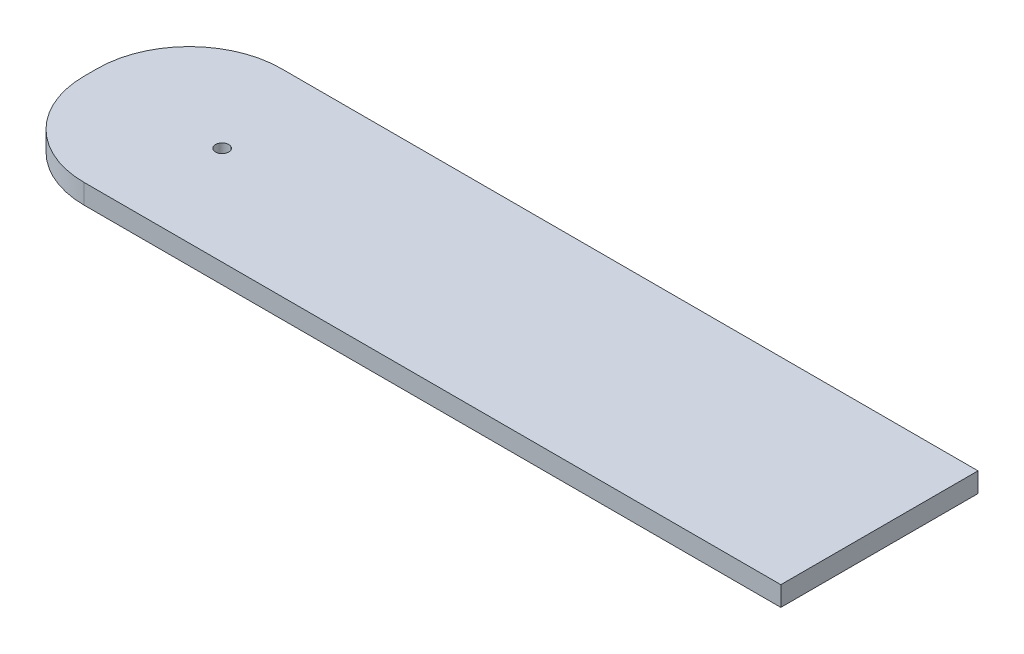
ISO-10303-21;
HEADER;
FILE_DESCRIPTION(('STEP AP214'),'2;1');
FILE_NAME('part.step','',(''),(''),'','','');
FILE_SCHEMA(('AUTOMOTIVE_DESIGN { 1 0 10303 214 1 1 1 1 }'));
ENDSEC;
DATA;
#1=APPLICATION_CONTEXT('core data for automotive mechanical design processes');
#2=APPLICATION_PROTOCOL_DEFINITION('international standard','automotive_design',2000,#1);
#3=PRODUCT_CONTEXT('',#1,'mechanical');
#4=PRODUCT('Part','Part','',(#3));
#5=PRODUCT_RELATED_PRODUCT_CATEGORY('part','',(#4));
#6=PRODUCT_DEFINITION_FORMATION('','',#4);
#7=PRODUCT_DEFINITION_CONTEXT('part definition',#1,'design');
#8=PRODUCT_DEFINITION('design','',#6,#7);
#9=PRODUCT_DEFINITION_SHAPE('','',#8);
#10=(LENGTH_UNIT() NAMED_UNIT(*) SI_UNIT(.MILLI.,.METRE.));
#11=(NAMED_UNIT(*) PLANE_ANGLE_UNIT() SI_UNIT($,.RADIAN.));
#12=(NAMED_UNIT(*) SI_UNIT($,.STERADIAN.) SOLID_ANGLE_UNIT());
#13=UNCERTAINTY_MEASURE_WITH_UNIT(LENGTH_MEASURE(1.E-05),#10,'distance_accuracy_value','');
#14=(GEOMETRIC_REPRESENTATION_CONTEXT(3) GLOBAL_UNCERTAINTY_ASSIGNED_CONTEXT((#13)) GLOBAL_UNIT_ASSIGNED_CONTEXT((#10,
#11,#12)) REPRESENTATION_CONTEXT('',''));
#15=CARTESIAN_POINT('',(0.,0.,0.));
#16=DIRECTION('',(0.,0.,1.));
#17=DIRECTION('',(1.,0.,0.));
#18=AXIS2_PLACEMENT_3D('',#15,#16,#17);
#19=CARTESIAN_POINT('',(0.,3.,0.));
#20=DIRECTION('',(1.,0.,0.));
#21=DIRECTION('',(0.,0.,-1.));
#22=AXIS2_PLACEMENT_3D('',#19,#20,#21);
#23=PLANE('',#22);
#24=DIRECTION('',(0.,0.,1.));
#25=VECTOR('',#24,1.);
#26=CARTESIAN_POINT('',(0.,3.,0.));
#27=LINE('',#26,#25);
#28=CARTESIAN_POINT('',(0.,3.,-16.));
#29=VERTEX_POINT('',#28);
#30=CARTESIAN_POINT('',(0.,3.,-14.));
#31=VERTEX_POINT('',#30);
#32=EDGE_CURVE('E102',#29,#31,#27,.T.);
#33=ORIENTED_EDGE('',*,*,#32,.F.);
#34=DIRECTION('',(0.,-1.,0.));
#35=VECTOR('',#34,1.);
#36=CARTESIAN_POINT('',(0.,3.,-16.));
#37=LINE('',#36,#35);
#38=CARTESIAN_POINT('',(0.,0.,-16.));
#39=VERTEX_POINT('',#38);
#40=EDGE_CURVE('E141',#29,#39,#37,.T.);
#41=ORIENTED_EDGE('',*,*,#40,.T.);
#42=DIRECTION('',(0.,0.,1.));
#43=VECTOR('',#42,1.);
#44=CARTESIAN_POINT('',(0.,0.,0.));
#45=LINE('',#44,#43);
#46=CARTESIAN_POINT('',(0.,0.,-14.));
#47=VERTEX_POINT('',#46);
#48=EDGE_CURVE('E124',#39,#47,#45,.T.);
#49=ORIENTED_EDGE('',*,*,#48,.T.);
#50=DIRECTION('',(0.,-1.,0.));
#51=VECTOR('',#50,1.);
#52=CARTESIAN_POINT('',(0.,3.,-14.));
#53=LINE('',#52,#51);
#54=EDGE_CURVE('E112',#47,#31,#53,.F.);
#55=ORIENTED_EDGE('',*,*,#54,.T.);
#56=EDGE_LOOP('',(#33,#41,#49,#55));
#57=FACE_BOUND('',#56,.T.);
#58=ADVANCED_FACE('F39',(#57),#23,.F.);
#59=CARTESIAN_POINT('',(0.,3.,0.));
#60=DIRECTION('',(0.,0.,-1.));
#61=DIRECTION('',(-1.,0.,0.));
#62=AXIS2_PLACEMENT_3D('',#59,#60,#61);
#63=PLANE('',#62);
#64=DIRECTION('',(1.,0.,0.));
#65=VECTOR('',#64,1.);
#66=CARTESIAN_POINT('',(0.,3.,0.));
#67=LINE('',#66,#65);
#68=CARTESIAN_POINT('',(14.,3.,0.));
#69=VERTEX_POINT('',#68);
#70=CARTESIAN_POINT('',(120.,3.,0.));
#71=VERTEX_POINT('',#70);
#72=EDGE_CURVE('E93',#69,#71,#67,.T.);
#73=ORIENTED_EDGE('',*,*,#72,.F.);
#74=DIRECTION('',(0.,-1.,0.));
#75=VECTOR('',#74,1.);
#76=CARTESIAN_POINT('',(14.,3.,0.));
#77=LINE('',#76,#75);
#78=CARTESIAN_POINT('',(14.,0.,0.));
#79=VERTEX_POINT('',#78);
#80=EDGE_CURVE('E11',#69,#79,#77,.T.);
#81=ORIENTED_EDGE('',*,*,#80,.T.);
#82=DIRECTION('',(1.,0.,0.));
#83=VECTOR('',#82,1.);
#84=CARTESIAN_POINT('',(0.,0.,0.));
#85=LINE('',#84,#83);
#86=CARTESIAN_POINT('',(120.,0.,0.));
#87=VERTEX_POINT('',#86);
#88=EDGE_CURVE('E108',#79,#87,#85,.T.);
#89=ORIENTED_EDGE('',*,*,#88,.T.);
#90=DIRECTION('',(0.,-1.,0.));
#91=VECTOR('',#90,1.);
#92=CARTESIAN_POINT('',(120.,3.,0.));
#93=LINE('',#92,#91);
#94=EDGE_CURVE('E105',#71,#87,#93,.T.);
#95=ORIENTED_EDGE('',*,*,#94,.F.);
#96=EDGE_LOOP('',(#73,#81,#89,#95));
#97=FACE_BOUND('',#96,.T.);
#98=ADVANCED_FACE('F106',(#97),#63,.F.);
#99=CARTESIAN_POINT('',(120.,3.,0.));
#100=DIRECTION('',(-1.,0.,0.));
#101=DIRECTION('',(0.,0.,1.));
#102=AXIS2_PLACEMENT_3D('',#99,#100,#101);
#103=PLANE('',#102);
#104=DIRECTION('',(0.,0.,-1.));
#105=VECTOR('',#104,1.);
#106=CARTESIAN_POINT('',(120.,0.,0.));
#107=LINE('',#106,#105);
#108=CARTESIAN_POINT('',(120.,0.,-30.));
#109=VERTEX_POINT('',#108);
#110=EDGE_CURVE('E131',#87,#109,#107,.T.);
#111=ORIENTED_EDGE('',*,*,#110,.T.);
#112=DIRECTION('',(0.,-1.,0.));
#113=VECTOR('',#112,1.);
#114=CARTESIAN_POINT('',(120.,3.,-30.));
#115=LINE('',#114,#113);
#116=CARTESIAN_POINT('',(120.,3.,-30.));
#117=VERTEX_POINT('',#116);
#118=EDGE_CURVE('E113',#117,#109,#115,.T.);
#119=ORIENTED_EDGE('',*,*,#118,.F.);
#120=DIRECTION('',(0.,0.,-1.));
#121=VECTOR('',#120,1.);
#122=CARTESIAN_POINT('',(120.,3.,0.));
#123=LINE('',#122,#121);
#124=EDGE_CURVE('E97',#71,#117,#123,.T.);
#125=ORIENTED_EDGE('',*,*,#124,.F.);
#126=ORIENTED_EDGE('',*,*,#94,.T.);
#127=EDGE_LOOP('',(#111,#119,#125,#126));
#128=FACE_BOUND('',#127,.T.);
#129=ADVANCED_FACE('F115',(#128),#103,.F.);
#130=CARTESIAN_POINT('',(0.,3.,-30.));
#131=DIRECTION('',(0.,0.,1.));
#132=DIRECTION('',(1.,0.,0.));
#133=AXIS2_PLACEMENT_3D('',#130,#131,#132);
#134=PLANE('',#133);
#135=DIRECTION('',(-1.,0.,0.));
#136=VECTOR('',#135,1.);
#137=CARTESIAN_POINT('',(0.,0.,-30.));
#138=LINE('',#137,#136);
#139=CARTESIAN_POINT('',(14.,0.,-30.));
#140=VERTEX_POINT('',#139);
#141=EDGE_CURVE('E134',#109,#140,#138,.T.);
#142=ORIENTED_EDGE('',*,*,#141,.T.);
#143=DIRECTION('',(0.,-1.,0.));
#144=VECTOR('',#143,1.);
#145=CARTESIAN_POINT('',(14.,3.,-30.));
#146=LINE('',#145,#144);
#147=CARTESIAN_POINT('',(14.,3.,-30.));
#148=VERTEX_POINT('',#147);
#149=EDGE_CURVE('E63',#140,#148,#146,.F.);
#150=ORIENTED_EDGE('',*,*,#149,.T.);
#151=DIRECTION('',(-1.,0.,0.));
#152=VECTOR('',#151,1.);
#153=CARTESIAN_POINT('',(0.,3.,-30.));
#154=LINE('',#153,#152);
#155=EDGE_CURVE('E118',#117,#148,#154,.T.);
#156=ORIENTED_EDGE('',*,*,#155,.F.);
#157=ORIENTED_EDGE('',*,*,#118,.T.);
#158=EDGE_LOOP('',(#142,#150,#156,#157));
#159=FACE_BOUND('',#158,.T.);
#160=ADVANCED_FACE('F167',(#159),#134,.F.);
#161=CARTESIAN_POINT('',(0.,3.,0.));
#162=DIRECTION('',(0.,-1.,0.));
#163=DIRECTION('',(0.,0.,-1.));
#164=AXIS2_PLACEMENT_3D('',#161,#162,#163);
#165=PLANE('',#164);
#166=CARTESIAN_POINT('',(20.,3.,-15.));
#167=DIRECTION('',(0.,1.,0.));
#168=DIRECTION('',(0.,0.,1.));
#169=AXIS2_PLACEMENT_3D('',#166,#167,#168);
#170=CIRCLE('',#169,1.);
#171=CARTESIAN_POINT('',(20.,3.,-14.));
#172=VERTEX_POINT('',#171);
#173=EDGE_CURVE('E202',#172,#172,#170,.T.);
#174=ORIENTED_EDGE('',*,*,#173,.F.);
#175=EDGE_LOOP('',(#174));
#176=FACE_BOUND('',#175,.T.);
#177=ORIENTED_EDGE('',*,*,#155,.T.);
#178=CARTESIAN_POINT('',(14.,3.,-16.));
#179=DIRECTION('',(0.,-1.,0.));
#180=DIRECTION('',(0.,0.,-1.));
#181=AXIS2_PLACEMENT_3D('',#178,#179,#180);
#182=CIRCLE('',#181,14.);
#183=EDGE_CURVE('E48',#148,#29,#182,.F.);
#184=ORIENTED_EDGE('',*,*,#183,.T.);
#185=ORIENTED_EDGE('',*,*,#32,.T.);
#186=CARTESIAN_POINT('',(14.,3.,-14.));
#187=DIRECTION('',(0.,-1.,0.));
#188=DIRECTION('',(0.,0.,-1.));
#189=AXIS2_PLACEMENT_3D('',#186,#187,#188);
#190=CIRCLE('',#189,14.);
#191=EDGE_CURVE('E55',#31,#69,#190,.F.);
#192=ORIENTED_EDGE('',*,*,#191,.T.);
#193=ORIENTED_EDGE('',*,*,#72,.T.);
#194=ORIENTED_EDGE('',*,*,#124,.T.);
#195=EDGE_LOOP('',(#177,#184,#185,#192,#193,#194));
#196=FACE_BOUND('',#195,.T.);
#197=ADVANCED_FACE('F95',(#176,#196),#165,.F.);
#198=CARTESIAN_POINT('',(0.,0.,0.));
#199=DIRECTION('',(0.,-1.,0.));
#200=DIRECTION('',(0.,0.,-1.));
#201=AXIS2_PLACEMENT_3D('',#198,#199,#200);
#202=PLANE('',#201);
#203=CARTESIAN_POINT('',(20.,0.,-15.));
#204=DIRECTION('',(0.,1.,0.));
#205=DIRECTION('',(0.,0.,1.));
#206=AXIS2_PLACEMENT_3D('',#203,#204,#205);
#207=CIRCLE('',#206,1.);
#208=CARTESIAN_POINT('',(20.,0.,-14.));
#209=VERTEX_POINT('',#208);
#210=EDGE_CURVE('E128',#209,#209,#207,.T.);
#211=ORIENTED_EDGE('',*,*,#210,.T.);
#212=EDGE_LOOP('',(#211));
#213=FACE_BOUND('',#212,.T.);
#214=ORIENTED_EDGE('',*,*,#48,.F.);
#215=CARTESIAN_POINT('',(14.,0.,-16.));
#216=DIRECTION('',(0.,-1.,0.));
#217=DIRECTION('',(0.,0.,-1.));
#218=AXIS2_PLACEMENT_3D('',#215,#216,#217);
#219=CIRCLE('',#218,14.);
#220=EDGE_CURVE('E148',#39,#140,#219,.T.);
#221=ORIENTED_EDGE('',*,*,#220,.T.);
#222=ORIENTED_EDGE('',*,*,#141,.F.);
#223=ORIENTED_EDGE('',*,*,#110,.F.);
#224=ORIENTED_EDGE('',*,*,#88,.F.);
#225=CARTESIAN_POINT('',(14.,0.,-14.));
#226=DIRECTION('',(0.,-1.,0.));
#227=DIRECTION('',(0.,0.,-1.));
#228=AXIS2_PLACEMENT_3D('',#225,#226,#227);
#229=CIRCLE('',#228,14.);
#230=EDGE_CURVE('E145',#79,#47,#229,.T.);
#231=ORIENTED_EDGE('',*,*,#230,.T.);
#232=EDGE_LOOP('',(#214,#221,#222,#223,#224,#231));
#233=FACE_BOUND('',#232,.T.);
#234=ADVANCED_FACE('F166',(#213,#233),#202,.T.);
#235=CARTESIAN_POINT('',(20.,0.,-15.));
#236=DIRECTION('',(0.,1.,0.));
#237=DIRECTION('',(0.,0.,1.));
#238=AXIS2_PLACEMENT_3D('',#235,#236,#237);
#239=CYLINDRICAL_SURFACE('',#238,1.);
#240=ORIENTED_EDGE('',*,*,#210,.F.);
#241=EDGE_LOOP('',(#240));
#242=FACE_BOUND('',#241,.T.);
#243=ORIENTED_EDGE('',*,*,#173,.T.);
#244=EDGE_LOOP('',(#243));
#245=FACE_BOUND('',#244,.T.);
#246=ADVANCED_FACE('F185',(#242,#245),#239,.F.);
#247=CARTESIAN_POINT('',(14.,3.,-16.));
#248=DIRECTION('',(0.,-1.,0.));
#249=DIRECTION('',(0.,0.,-1.));
#250=AXIS2_PLACEMENT_3D('',#247,#248,#249);
#251=CYLINDRICAL_SURFACE('',#250,14.);
#252=ORIENTED_EDGE('',*,*,#183,.F.);
#253=ORIENTED_EDGE('',*,*,#149,.F.);
#254=ORIENTED_EDGE('',*,*,#220,.F.);
#255=ORIENTED_EDGE('',*,*,#40,.F.);
#256=EDGE_LOOP('',(#252,#253,#254,#255));
#257=FACE_BOUND('',#256,.T.);
#258=ADVANCED_FACE('F163',(#257),#251,.T.);
#259=CARTESIAN_POINT('',(14.,3.,-14.));
#260=DIRECTION('',(0.,-1.,0.));
#261=DIRECTION('',(0.,0.,-1.));
#262=AXIS2_PLACEMENT_3D('',#259,#260,#261);
#263=CYLINDRICAL_SURFACE('',#262,14.);
#264=ORIENTED_EDGE('',*,*,#191,.F.);
#265=ORIENTED_EDGE('',*,*,#54,.F.);
#266=ORIENTED_EDGE('',*,*,#230,.F.);
#267=ORIENTED_EDGE('',*,*,#80,.F.);
#268=EDGE_LOOP('',(#264,#265,#266,#267));
#269=FACE_BOUND('',#268,.T.);
#270=ADVANCED_FACE('F41',(#269),#263,.T.);
#271=CLOSED_SHELL('',(#58,#98,#129,#160,#197,#234,#246,#258,#270));
#272=MANIFOLD_SOLID_BREP('B2',#271);
#273=ADVANCED_BREP_SHAPE_REPRESENTATION('',(#18,#272),#14);
#274=SHAPE_DEFINITION_REPRESENTATION(#9,#273);
ENDSEC;
END-ISO-10303-21;
